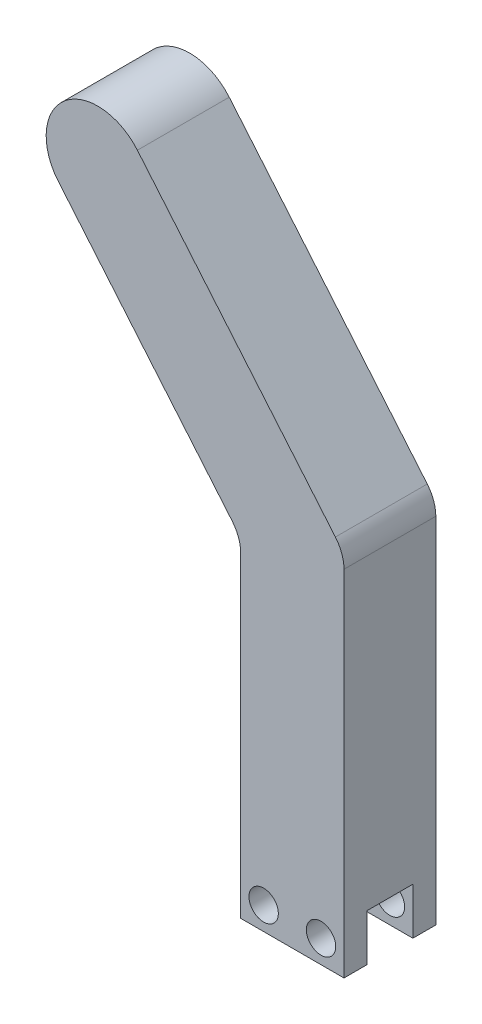
ISO-10303-21;
HEADER;
FILE_DESCRIPTION(('STEP AP214'),'2;1');
FILE_NAME('part.step','',(''),(''),'','','');
FILE_SCHEMA(('AUTOMOTIVE_DESIGN { 1 0 10303 214 1 1 1 1 }'));
ENDSEC;
DATA;
#1=APPLICATION_CONTEXT('core data for automotive mechanical design processes');
#2=APPLICATION_PROTOCOL_DEFINITION('international standard','automotive_design',2000,#1);
#3=PRODUCT_CONTEXT('',#1,'mechanical');
#4=PRODUCT('Part','Part','',(#3));
#5=PRODUCT_RELATED_PRODUCT_CATEGORY('part','',(#4));
#6=PRODUCT_DEFINITION_FORMATION('','',#4);
#7=PRODUCT_DEFINITION_CONTEXT('part definition',#1,'design');
#8=PRODUCT_DEFINITION('design','',#6,#7);
#9=PRODUCT_DEFINITION_SHAPE('','',#8);
#10=(LENGTH_UNIT() NAMED_UNIT(*) SI_UNIT(.MILLI.,.METRE.));
#11=(NAMED_UNIT(*) PLANE_ANGLE_UNIT() SI_UNIT($,.RADIAN.));
#12=(NAMED_UNIT(*) SI_UNIT($,.STERADIAN.) SOLID_ANGLE_UNIT());
#13=UNCERTAINTY_MEASURE_WITH_UNIT(LENGTH_MEASURE(1.E-05),#10,'distance_accuracy_value','');
#14=(GEOMETRIC_REPRESENTATION_CONTEXT(3) GLOBAL_UNCERTAINTY_ASSIGNED_CONTEXT((#13)) GLOBAL_UNIT_ASSIGNED_CONTEXT((#10,
#11,#12)) REPRESENTATION_CONTEXT('',''));
#15=CARTESIAN_POINT('',(0.,0.,0.));
#16=DIRECTION('',(0.,0.,1.));
#17=DIRECTION('',(1.,0.,0.));
#18=AXIS2_PLACEMENT_3D('',#15,#16,#17);
#19=CARTESIAN_POINT('',(0.,-6.35,12.7));
#20=DIRECTION('',(0.,-1.,0.));
#21=DIRECTION('',(1.,0.,0.));
#22=AXIS2_PLACEMENT_3D('',#19,#20,#21);
#23=PLANE('',#22);
#24=DIRECTION('',(-1.,0.,0.));
#25=VECTOR('',#24,1.);
#26=CARTESIAN_POINT('',(0.,-6.35,3.175));
#27=LINE('',#26,#25);
#28=CARTESIAN_POINT('',(0.,-6.35,3.175));
#29=VERTEX_POINT('',#28);
#30=CARTESIAN_POINT('',(-14.2875,-6.35,3.175));
#31=VERTEX_POINT('',#30);
#32=EDGE_CURVE('E128',#29,#31,#27,.T.);
#33=ORIENTED_EDGE('',*,*,#32,.T.);
#34=DIRECTION('',(0.,0.,-1.));
#35=VECTOR('',#34,1.);
#36=CARTESIAN_POINT('',(-14.2875,-6.35,12.7));
#37=LINE('',#36,#35);
#38=CARTESIAN_POINT('',(-14.2875,-6.35,0.));
#39=VERTEX_POINT('',#38);
#40=EDGE_CURVE('E162',#31,#39,#37,.T.);
#41=ORIENTED_EDGE('',*,*,#40,.T.);
#42=DIRECTION('',(-1.,0.,0.));
#43=VECTOR('',#42,1.);
#44=CARTESIAN_POINT('',(0.,-6.35,0.));
#45=LINE('',#44,#43);
#46=CARTESIAN_POINT('',(0.,-6.35,0.));
#47=VERTEX_POINT('',#46);
#48=EDGE_CURVE('E154',#47,#39,#45,.T.);
#49=ORIENTED_EDGE('',*,*,#48,.F.);
#50=DIRECTION('',(0.,0.,-1.));
#51=VECTOR('',#50,1.);
#52=CARTESIAN_POINT('',(0.,-6.35,12.7));
#53=LINE('',#52,#51);
#54=EDGE_CURVE('E146',#29,#47,#53,.T.);
#55=ORIENTED_EDGE('',*,*,#54,.F.);
#56=EDGE_LOOP('',(#33,#41,#49,#55));
#57=FACE_BOUND('',#56,.T.);
#58=ADVANCED_FACE('F38',(#57),#23,.T.);
#59=CARTESIAN_POINT('',(-3.175,-3.175,12.7));
#60=DIRECTION('',(0.,0.,-1.));
#61=DIRECTION('',(-1.,0.,0.));
#62=AXIS2_PLACEMENT_3D('',#59,#60,#61);
#63=CYLINDRICAL_SURFACE('',#62,2.032);
#64=CARTESIAN_POINT('',(-3.175,-3.175,3.175));
#65=DIRECTION('',(0.,0.,-1.));
#66=DIRECTION('',(-1.,0.,0.));
#67=AXIS2_PLACEMENT_3D('',#64,#65,#66);
#68=CIRCLE('',#67,2.032);
#69=CARTESIAN_POINT('',(-5.20699999999999,-3.175,3.175));
#70=VERTEX_POINT('',#69);
#71=EDGE_CURVE('E237',#70,#70,#68,.T.);
#72=ORIENTED_EDGE('',*,*,#71,.F.);
#73=EDGE_LOOP('',(#72));
#74=FACE_BOUND('',#73,.T.);
#75=CARTESIAN_POINT('',(-3.175,-3.175,0.));
#76=DIRECTION('',(0.,0.,1.));
#77=DIRECTION('',(1.,0.,0.));
#78=AXIS2_PLACEMENT_3D('',#75,#76,#77);
#79=CIRCLE('',#78,2.032);
#80=CARTESIAN_POINT('',(-1.143,-3.175,0.));
#81=VERTEX_POINT('',#80);
#82=EDGE_CURVE('E236',#81,#81,#79,.T.);
#83=ORIENTED_EDGE('',*,*,#82,.F.);
#84=EDGE_LOOP('',(#83));
#85=FACE_BOUND('',#84,.T.);
#86=ADVANCED_FACE('F325',(#74,#85),#63,.F.);
#87=CARTESIAN_POINT('',(-11.1125,-3.175,12.7));
#88=DIRECTION('',(0.,0.,-1.));
#89=DIRECTION('',(-1.,0.,0.));
#90=AXIS2_PLACEMENT_3D('',#87,#88,#89);
#91=CYLINDRICAL_SURFACE('',#90,2.032);
#92=CARTESIAN_POINT('',(-11.1125,-3.175,3.175));
#93=DIRECTION('',(0.,0.,-1.));
#94=DIRECTION('',(-1.,0.,0.));
#95=AXIS2_PLACEMENT_3D('',#92,#93,#94);
#96=CIRCLE('',#95,2.032);
#97=CARTESIAN_POINT('',(-13.1445,-3.175,3.175));
#98=VERTEX_POINT('',#97);
#99=EDGE_CURVE('E315',#98,#98,#96,.T.);
#100=ORIENTED_EDGE('',*,*,#99,.F.);
#101=EDGE_LOOP('',(#100));
#102=FACE_BOUND('',#101,.T.);
#103=CARTESIAN_POINT('',(-11.1125,-3.175,0.));
#104=DIRECTION('',(0.,0.,1.));
#105=DIRECTION('',(1.,0.,0.));
#106=AXIS2_PLACEMENT_3D('',#103,#104,#105);
#107=CIRCLE('',#106,2.032);
#108=CARTESIAN_POINT('',(-9.0805,-3.175,0.));
#109=VERTEX_POINT('',#108);
#110=EDGE_CURVE('E232',#109,#109,#107,.T.);
#111=ORIENTED_EDGE('',*,*,#110,.F.);
#112=EDGE_LOOP('',(#111));
#113=FACE_BOUND('',#112,.T.);
#114=ADVANCED_FACE('F328',(#102,#113),#91,.F.);
#115=CARTESIAN_POINT('',(21.8873523106963,18.3656692513525,12.7));
#116=DIRECTION('',(-0.766044443118977,-0.64278760968654,0.));
#117=DIRECTION('',(0.64278760968654,-0.766044443118977,0.));
#118=AXIS2_PLACEMENT_3D('',#115,#116,#117);
#119=PLANE('',#118);
#120=DIRECTION('',(-0.64278760968654,0.766044443118977,0.));
#121=VECTOR('',#120,1.);
#122=CARTESIAN_POINT('',(21.8873523106963,18.3656692513525,12.7));
#123=LINE('',#122,#121);
#124=CARTESIAN_POINT('',(-1.18849422895555,45.8663922671353,12.7));
#125=VERTEX_POINT('',#124);
#126=CARTESIAN_POINT('',(-28.5719092505667,78.5006754966385,12.7));
#127=VERTEX_POINT('',#126);
#128=EDGE_CURVE('E258',#125,#127,#123,.T.);
#129=ORIENTED_EDGE('',*,*,#128,.F.);
#130=DIRECTION('',(0.,0.,-1.));
#131=VECTOR('',#130,1.);
#132=CARTESIAN_POINT('',(-1.18849422895554,45.8663922671353,0.));
#133=LINE('',#132,#131);
#134=CARTESIAN_POINT('',(-1.18849422895555,45.8663922671353,0.));
#135=VERTEX_POINT('',#134);
#136=EDGE_CURVE('E181',#125,#135,#133,.T.);
#137=ORIENTED_EDGE('',*,*,#136,.T.);
#138=DIRECTION('',(-0.64278760968654,0.766044443118977,0.));
#139=VECTOR('',#138,1.);
#140=CARTESIAN_POINT('',(21.8873523106963,18.3656692513525,0.));
#141=LINE('',#140,#139);
#142=CARTESIAN_POINT('',(-28.5719092505667,78.5006754966385,0.));
#143=VERTEX_POINT('',#142);
#144=EDGE_CURVE('E241',#135,#143,#141,.T.);
#145=ORIENTED_EDGE('',*,*,#144,.T.);
#146=DIRECTION('',(0.,0.,-1.));
#147=VECTOR('',#146,1.);
#148=CARTESIAN_POINT('',(-28.5719092505667,78.5006754966385,12.7));
#149=LINE('',#148,#147);
#150=EDGE_CURVE('E177',#127,#143,#149,.T.);
#151=ORIENTED_EDGE('',*,*,#150,.F.);
#152=EDGE_LOOP('',(#129,#137,#145,#151));
#153=FACE_BOUND('',#152,.T.);
#154=ADVANCED_FACE('F274',(#153),#119,.F.);
#155=CARTESIAN_POINT('',(-34.0443392410979,73.9087615099403,12.7));
#156=DIRECTION('',(0.,0.,-1.));
#157=DIRECTION('',(-1.,0.,0.));
#158=AXIS2_PLACEMENT_3D('',#155,#156,#157);
#159=CYLINDRICAL_SURFACE('',#158,7.14375000000002);
#160=CARTESIAN_POINT('',(-34.0443392410979,73.9087615099403,0.));
#161=DIRECTION('',(0.,0.,1.));
#162=DIRECTION('',(1.,0.,0.));
#163=AXIS2_PLACEMENT_3D('',#160,#161,#162);
#164=CIRCLE('',#163,7.14375000000002);
#165=CARTESIAN_POINT('',(-39.5167692316291,69.3168475232421,0.));
#166=VERTEX_POINT('',#165);
#167=EDGE_CURVE('E214',#143,#166,#164,.T.);
#168=ORIENTED_EDGE('',*,*,#167,.T.);
#169=DIRECTION('',(0.,0.,-1.));
#170=VECTOR('',#169,1.);
#171=CARTESIAN_POINT('',(-39.5167692316291,69.3168475232421,12.7));
#172=LINE('',#171,#170);
#173=CARTESIAN_POINT('',(-39.5167692316291,69.3168475232421,12.7));
#174=VERTEX_POINT('',#173);
#175=EDGE_CURVE('E173',#174,#166,#172,.T.);
#176=ORIENTED_EDGE('',*,*,#175,.F.);
#177=CARTESIAN_POINT('',(-34.0443392410979,73.9087615099403,12.7));
#178=DIRECTION('',(0.,0.,1.));
#179=DIRECTION('',(1.,0.,0.));
#180=AXIS2_PLACEMENT_3D('',#177,#178,#179);
#181=CIRCLE('',#180,7.14375000000002);
#182=EDGE_CURVE('E228',#127,#174,#181,.T.);
#183=ORIENTED_EDGE('',*,*,#182,.F.);
#184=ORIENTED_EDGE('',*,*,#150,.T.);
#185=EDGE_LOOP('',(#168,#176,#183,#184));
#186=FACE_BOUND('',#185,.T.);
#187=ADVANCED_FACE('F272',(#186),#159,.T.);
#188=CARTESIAN_POINT('',(10.9424923296339,9.18184127795606,12.7));
#189=DIRECTION('',(-0.766044443118977,-0.64278760968654,0.));
#190=DIRECTION('',(0.64278760968654,-0.766044443118977,0.));
#191=AXIS2_PLACEMENT_3D('',#188,#189,#190);
#192=PLANE('',#191);
#193=DIRECTION('',(-0.64278760968654,0.766044443118977,0.));
#194=VECTOR('',#193,1.);
#195=CARTESIAN_POINT('',(10.9424923296339,9.18184127795606,0.));
#196=LINE('',#195,#194);
#197=CARTESIAN_POINT('',(-15.4759942289556,40.6661675450569,0.));
#198=VERTEX_POINT('',#197);
#199=EDGE_CURVE('E205',#198,#166,#196,.T.);
#200=ORIENTED_EDGE('',*,*,#199,.F.);
#201=DIRECTION('',(0.,0.,-1.));
#202=VECTOR('',#201,1.);
#203=CARTESIAN_POINT('',(-15.4759942289556,40.6661675450569,12.7));
#204=LINE('',#203,#202);
#205=CARTESIAN_POINT('',(-15.4759942289556,40.6661675450569,12.7));
#206=VERTEX_POINT('',#205);
#207=EDGE_CURVE('E60',#198,#206,#204,.F.);
#208=ORIENTED_EDGE('',*,*,#207,.T.);
#209=DIRECTION('',(-0.64278760968654,0.766044443118977,0.));
#210=VECTOR('',#209,1.);
#211=CARTESIAN_POINT('',(10.9424923296339,9.18184127795606,12.7));
#212=LINE('',#211,#210);
#213=EDGE_CURVE('E223',#206,#174,#212,.T.);
#214=ORIENTED_EDGE('',*,*,#213,.T.);
#215=ORIENTED_EDGE('',*,*,#175,.T.);
#216=EDGE_LOOP('',(#200,#208,#214,#215));
#217=FACE_BOUND('',#216,.T.);
#218=ADVANCED_FACE('F210',(#217),#192,.T.);
#219=CARTESIAN_POINT('',(-14.2875,0.,12.7));
#220=DIRECTION('',(-1.,0.,0.));
#221=DIRECTION('',(0.,-1.,0.));
#222=AXIS2_PLACEMENT_3D('',#219,#220,#221);
#223=PLANE('',#222);
#224=DIRECTION('',(0.,1.,0.));
#225=VECTOR('',#224,1.);
#226=CARTESIAN_POINT('',(-14.2875,0.,12.7));
#227=LINE('',#226,#225);
#228=CARTESIAN_POINT('',(-14.2875,-6.35,12.7));
#229=VERTEX_POINT('',#228);
#230=CARTESIAN_POINT('',(-14.2875,37.4008064878493,12.7));
#231=VERTEX_POINT('',#230);
#232=EDGE_CURVE('E218',#229,#231,#227,.T.);
#233=ORIENTED_EDGE('',*,*,#232,.T.);
#234=DIRECTION('',(0.,0.,-1.));
#235=VECTOR('',#234,1.);
#236=CARTESIAN_POINT('',(-14.2875,37.4008064878493,0.));
#237=LINE('',#236,#235);
#238=CARTESIAN_POINT('',(-14.2875,37.4008064878493,0.));
#239=VERTEX_POINT('',#238);
#240=EDGE_CURVE('E194',#231,#239,#237,.T.);
#241=ORIENTED_EDGE('',*,*,#240,.T.);
#242=DIRECTION('',(0.,1.,0.));
#243=VECTOR('',#242,1.);
#244=CARTESIAN_POINT('',(-14.2875,0.,0.));
#245=LINE('',#244,#243);
#246=EDGE_CURVE('E207',#39,#239,#245,.T.);
#247=ORIENTED_EDGE('',*,*,#246,.F.);
#248=ORIENTED_EDGE('',*,*,#40,.F.);
#249=DIRECTION('',(0.,-1.,0.));
#250=VECTOR('',#249,1.);
#251=CARTESIAN_POINT('',(-14.2875,-6.35,3.175));
#252=LINE('',#251,#250);
#253=CARTESIAN_POINT('',(-14.2875,0.121919999999995,3.175));
#254=VERTEX_POINT('',#253);
#255=EDGE_CURVE('E134',#254,#31,#252,.T.);
#256=ORIENTED_EDGE('',*,*,#255,.F.);
#257=DIRECTION('',(0.,0.,-1.));
#258=VECTOR('',#257,1.);
#259=CARTESIAN_POINT('',(-14.2875,0.121919999999995,3.175));
#260=LINE('',#259,#258);
#261=CARTESIAN_POINT('',(-14.2875,0.121919999999997,9.525));
#262=VERTEX_POINT('',#261);
#263=EDGE_CURVE('E151',#262,#254,#260,.T.);
#264=ORIENTED_EDGE('',*,*,#263,.F.);
#265=DIRECTION('',(0.,1.,0.));
#266=VECTOR('',#265,1.);
#267=CARTESIAN_POINT('',(-14.2875,0.121919999999997,9.525));
#268=LINE('',#267,#266);
#269=CARTESIAN_POINT('',(-14.2875,-6.35,9.525));
#270=VERTEX_POINT('',#269);
#271=EDGE_CURVE('E293',#270,#262,#268,.T.);
#272=ORIENTED_EDGE('',*,*,#271,.F.);
#273=EDGE_CURVE('E169',#229,#270,#37,.T.);
#274=ORIENTED_EDGE('',*,*,#273,.F.);
#275=EDGE_LOOP('',(#233,#241,#247,#248,#256,#264,#272,#274));
#276=FACE_BOUND('',#275,.T.);
#277=ADVANCED_FACE('F217',(#276),#223,.T.);
#278=DIRECTION('',(-1.,0.,0.));
#279=VECTOR('',#278,1.);
#280=CARTESIAN_POINT('',(0.,-6.35,9.525));
#281=LINE('',#280,#279);
#282=CARTESIAN_POINT('',(0.,-6.35,9.525));
#283=VERTEX_POINT('',#282);
#284=EDGE_CURVE('E139',#283,#270,#281,.T.);
#285=ORIENTED_EDGE('',*,*,#284,.F.);
#286=CARTESIAN_POINT('',(0.,-6.35,12.7));
#287=VERTEX_POINT('',#286);
#288=EDGE_CURVE('E156',#287,#283,#53,.T.);
#289=ORIENTED_EDGE('',*,*,#288,.F.);
#290=DIRECTION('',(-1.,0.,0.));
#291=VECTOR('',#290,1.);
#292=CARTESIAN_POINT('',(0.,-6.35,12.7));
#293=LINE('',#292,#291);
#294=EDGE_CURVE('E163',#287,#229,#293,.T.);
#295=ORIENTED_EDGE('',*,*,#294,.T.);
#296=ORIENTED_EDGE('',*,*,#273,.T.);
#297=EDGE_LOOP('',(#285,#289,#295,#296));
#298=FACE_BOUND('',#297,.T.);
#299=ADVANCED_FACE('F283',(#298),#23,.T.);
#300=CARTESIAN_POINT('',(-3.175,-3.175,9.525));
#301=DIRECTION('',(0.,0.,1.));
#302=DIRECTION('',(0.,-1.,0.));
#303=AXIS2_PLACEMENT_3D('',#300,#301,#302);
#304=CIRCLE('',#303,2.032);
#305=CARTESIAN_POINT('',(-3.175,-5.20699999999999,9.525));
#306=VERTEX_POINT('',#305);
#307=EDGE_CURVE('E312',#306,#306,#304,.T.);
#308=ORIENTED_EDGE('',*,*,#307,.F.);
#309=EDGE_LOOP('',(#308));
#310=FACE_BOUND('',#309,.T.);
#311=CARTESIAN_POINT('',(-3.175,-3.175,12.7));
#312=DIRECTION('',(0.,0.,1.));
#313=DIRECTION('',(1.,0.,0.));
#314=AXIS2_PLACEMENT_3D('',#311,#312,#313);
#315=CIRCLE('',#314,2.032);
#316=CARTESIAN_POINT('',(-1.143,-3.175,12.7));
#317=VERTEX_POINT('',#316);
#318=EDGE_CURVE('E252',#317,#317,#315,.T.);
#319=ORIENTED_EDGE('',*,*,#318,.T.);
#320=EDGE_LOOP('',(#319));
#321=FACE_BOUND('',#320,.T.);
#322=ADVANCED_FACE('F330',(#310,#321),#63,.F.);
#323=CARTESIAN_POINT('',(-11.1125,-3.175,9.525));
#324=DIRECTION('',(0.,0.,1.));
#325=DIRECTION('',(0.,-1.,0.));
#326=AXIS2_PLACEMENT_3D('',#323,#324,#325);
#327=CIRCLE('',#326,2.032);
#328=CARTESIAN_POINT('',(-11.1125,-5.207,9.525));
#329=VERTEX_POINT('',#328);
#330=EDGE_CURVE('E303',#329,#329,#327,.T.);
#331=ORIENTED_EDGE('',*,*,#330,.F.);
#332=EDGE_LOOP('',(#331));
#333=FACE_BOUND('',#332,.T.);
#334=CARTESIAN_POINT('',(-11.1125,-3.175,12.7));
#335=DIRECTION('',(0.,0.,1.));
#336=DIRECTION('',(1.,0.,0.));
#337=AXIS2_PLACEMENT_3D('',#334,#335,#336);
#338=CIRCLE('',#337,2.032);
#339=CARTESIAN_POINT('',(-9.0805,-3.175,12.7));
#340=VERTEX_POINT('',#339);
#341=EDGE_CURVE('E249',#340,#340,#338,.T.);
#342=ORIENTED_EDGE('',*,*,#341,.T.);
#343=EDGE_LOOP('',(#342));
#344=FACE_BOUND('',#343,.T.);
#345=ADVANCED_FACE('F356',(#333,#344),#91,.F.);
#346=CARTESIAN_POINT('',(0.,0.,12.7));
#347=DIRECTION('',(1.,0.,0.));
#348=DIRECTION('',(0.,1.,0.));
#349=AXIS2_PLACEMENT_3D('',#346,#347,#348);
#350=PLANE('',#349);
#351=DIRECTION('',(0.,-1.,0.));
#352=VECTOR('',#351,1.);
#353=CARTESIAN_POINT('',(0.,0.,0.));
#354=LINE('',#353,#352);
#355=CARTESIAN_POINT('',(0.,42.6010312099276,0.));
#356=VERTEX_POINT('',#355);
#357=EDGE_CURVE('E167',#356,#47,#354,.T.);
#358=ORIENTED_EDGE('',*,*,#357,.F.);
#359=DIRECTION('',(0.,0.,-1.));
#360=VECTOR('',#359,1.);
#361=CARTESIAN_POINT('',(0.,42.6010312099276,12.7));
#362=LINE('',#361,#360);
#363=CARTESIAN_POINT('',(0.,42.6010312099276,12.7));
#364=VERTEX_POINT('',#363);
#365=EDGE_CURVE('E188',#356,#364,#362,.F.);
#366=ORIENTED_EDGE('',*,*,#365,.T.);
#367=DIRECTION('',(0.,-1.,0.));
#368=VECTOR('',#367,1.);
#369=CARTESIAN_POINT('',(0.,0.,12.7));
#370=LINE('',#369,#368);
#371=EDGE_CURVE('E157',#364,#287,#370,.T.);
#372=ORIENTED_EDGE('',*,*,#371,.T.);
#373=ORIENTED_EDGE('',*,*,#288,.T.);
#374=DIRECTION('',(0.,1.,0.));
#375=VECTOR('',#374,1.);
#376=CARTESIAN_POINT('',(0.,0.121919999999996,9.525));
#377=LINE('',#376,#375);
#378=CARTESIAN_POINT('',(0.,0.121919999999997,9.525));
#379=VERTEX_POINT('',#378);
#380=EDGE_CURVE('E150',#283,#379,#377,.T.);
#381=ORIENTED_EDGE('',*,*,#380,.T.);
#382=DIRECTION('',(0.,0.,-1.));
#383=VECTOR('',#382,1.);
#384=CARTESIAN_POINT('',(0.,0.121919999999994,3.175));
#385=LINE('',#384,#383);
#386=CARTESIAN_POINT('',(0.,0.121919999999994,3.175));
#387=VERTEX_POINT('',#386);
#388=EDGE_CURVE('E140',#379,#387,#385,.T.);
#389=ORIENTED_EDGE('',*,*,#388,.T.);
#390=DIRECTION('',(0.,-1.,0.));
#391=VECTOR('',#390,1.);
#392=CARTESIAN_POINT('',(0.,-6.35,3.175));
#393=LINE('',#392,#391);
#394=EDGE_CURVE('E131',#387,#29,#393,.T.);
#395=ORIENTED_EDGE('',*,*,#394,.T.);
#396=ORIENTED_EDGE('',*,*,#54,.T.);
#397=EDGE_LOOP('',(#358,#366,#372,#373,#381,#389,#395,#396));
#398=FACE_BOUND('',#397,.T.);
#399=ADVANCED_FACE('F145',(#398),#350,.T.);
#400=CARTESIAN_POINT('',(0.,0.,12.7));
#401=DIRECTION('',(0.,0.,1.));
#402=DIRECTION('',(1.,0.,0.));
#403=AXIS2_PLACEMENT_3D('',#400,#401,#402);
#404=PLANE('',#403);
#405=ORIENTED_EDGE('',*,*,#341,.F.);
#406=EDGE_LOOP('',(#405));
#407=FACE_BOUND('',#406,.T.);
#408=ORIENTED_EDGE('',*,*,#318,.F.);
#409=EDGE_LOOP('',(#408));
#410=FACE_BOUND('',#409,.T.);
#411=ORIENTED_EDGE('',*,*,#371,.F.);
#412=CARTESIAN_POINT('',(-5.07999999999995,42.6010312099276,12.7));
#413=DIRECTION('',(0.,0.,1.));
#414=DIRECTION('',(1.,0.,0.));
#415=AXIS2_PLACEMENT_3D('',#412,#413,#414);
#416=CIRCLE('',#415,5.08);
#417=EDGE_CURVE('E191',#364,#125,#416,.T.);
#418=ORIENTED_EDGE('',*,*,#417,.T.);
#419=ORIENTED_EDGE('',*,*,#128,.T.);
#420=ORIENTED_EDGE('',*,*,#182,.T.);
#421=ORIENTED_EDGE('',*,*,#213,.F.);
#422=CARTESIAN_POINT('',(-19.3675,37.4008064878493,12.7));
#423=DIRECTION('',(0.,0.,1.));
#424=DIRECTION('',(1.,0.,0.));
#425=AXIS2_PLACEMENT_3D('',#422,#423,#424);
#426=CIRCLE('',#425,5.08);
#427=EDGE_CURVE('E11',#206,#231,#426,.F.);
#428=ORIENTED_EDGE('',*,*,#427,.T.);
#429=ORIENTED_EDGE('',*,*,#232,.F.);
#430=ORIENTED_EDGE('',*,*,#294,.F.);
#431=EDGE_LOOP('',(#411,#418,#419,#420,#421,#428,#429,#430));
#432=FACE_BOUND('',#431,.T.);
#433=ADVANCED_FACE('F268',(#407,#410,#432),#404,.T.);
#434=CARTESIAN_POINT('',(0.,0.,0.));
#435=DIRECTION('',(0.,0.,1.));
#436=DIRECTION('',(1.,0.,0.));
#437=AXIS2_PLACEMENT_3D('',#434,#435,#436);
#438=PLANE('',#437);
#439=ORIENTED_EDGE('',*,*,#110,.T.);
#440=EDGE_LOOP('',(#439));
#441=FACE_BOUND('',#440,.T.);
#442=ORIENTED_EDGE('',*,*,#82,.T.);
#443=EDGE_LOOP('',(#442));
#444=FACE_BOUND('',#443,.T.);
#445=ORIENTED_EDGE('',*,*,#144,.F.);
#446=CARTESIAN_POINT('',(-5.07999999999995,42.6010312099276,0.));
#447=DIRECTION('',(0.,0.,1.));
#448=DIRECTION('',(1.,0.,0.));
#449=AXIS2_PLACEMENT_3D('',#446,#447,#448);
#450=CIRCLE('',#449,5.08);
#451=EDGE_CURVE('E185',#135,#356,#450,.F.);
#452=ORIENTED_EDGE('',*,*,#451,.T.);
#453=ORIENTED_EDGE('',*,*,#357,.T.);
#454=ORIENTED_EDGE('',*,*,#48,.T.);
#455=ORIENTED_EDGE('',*,*,#246,.T.);
#456=CARTESIAN_POINT('',(-19.3675,37.4008064878493,0.));
#457=DIRECTION('',(0.,0.,1.));
#458=DIRECTION('',(1.,0.,0.));
#459=AXIS2_PLACEMENT_3D('',#456,#457,#458);
#460=CIRCLE('',#459,5.08);
#461=EDGE_CURVE('E47',#239,#198,#460,.T.);
#462=ORIENTED_EDGE('',*,*,#461,.T.);
#463=ORIENTED_EDGE('',*,*,#199,.T.);
#464=ORIENTED_EDGE('',*,*,#167,.F.);
#465=EDGE_LOOP('',(#445,#452,#453,#454,#455,#462,#463,#464));
#466=FACE_BOUND('',#465,.T.);
#467=ADVANCED_FACE('F203',(#441,#444,#466),#438,.F.);
#468=CARTESIAN_POINT('',(0.,-6.35,3.175));
#469=DIRECTION('',(0.,0.,-1.));
#470=DIRECTION('',(-1.,0.,0.));
#471=AXIS2_PLACEMENT_3D('',#468,#469,#470);
#472=PLANE('',#471);
#473=ORIENTED_EDGE('',*,*,#71,.T.);
#474=EDGE_LOOP('',(#473));
#475=FACE_BOUND('',#474,.T.);
#476=ORIENTED_EDGE('',*,*,#99,.T.);
#477=EDGE_LOOP('',(#476));
#478=FACE_BOUND('',#477,.T.);
#479=ORIENTED_EDGE('',*,*,#255,.T.);
#480=ORIENTED_EDGE('',*,*,#32,.F.);
#481=ORIENTED_EDGE('',*,*,#394,.F.);
#482=DIRECTION('',(-1.,0.,0.));
#483=VECTOR('',#482,1.);
#484=CARTESIAN_POINT('',(0.,0.121919999999994,3.175));
#485=LINE('',#484,#483);
#486=EDGE_CURVE('E300',#387,#254,#485,.T.);
#487=ORIENTED_EDGE('',*,*,#486,.T.);
#488=EDGE_LOOP('',(#479,#480,#481,#487));
#489=FACE_BOUND('',#488,.T.);
#490=ADVANCED_FACE('F130',(#475,#478,#489),#472,.F.);
#491=CARTESIAN_POINT('',(0.,0.121919999999994,3.175));
#492=DIRECTION('',(0.,1.,0.));
#493=DIRECTION('',(0.,0.,1.));
#494=AXIS2_PLACEMENT_3D('',#491,#492,#493);
#495=PLANE('',#494);
#496=ORIENTED_EDGE('',*,*,#263,.T.);
#497=ORIENTED_EDGE('',*,*,#486,.F.);
#498=ORIENTED_EDGE('',*,*,#388,.F.);
#499=DIRECTION('',(-1.,0.,0.));
#500=VECTOR('',#499,1.);
#501=CARTESIAN_POINT('',(0.,0.121919999999996,9.525));
#502=LINE('',#501,#500);
#503=EDGE_CURVE('E304',#379,#262,#502,.T.);
#504=ORIENTED_EDGE('',*,*,#503,.T.);
#505=EDGE_LOOP('',(#496,#497,#498,#504));
#506=FACE_BOUND('',#505,.T.);
#507=ADVANCED_FACE('F341',(#506),#495,.F.);
#508=CARTESIAN_POINT('',(0.,0.121919999999996,9.525));
#509=DIRECTION('',(0.,0.,1.));
#510=DIRECTION('',(0.,-1.,0.));
#511=AXIS2_PLACEMENT_3D('',#508,#509,#510);
#512=PLANE('',#511);
#513=ORIENTED_EDGE('',*,*,#307,.T.);
#514=EDGE_LOOP('',(#513));
#515=FACE_BOUND('',#514,.T.);
#516=ORIENTED_EDGE('',*,*,#330,.T.);
#517=EDGE_LOOP('',(#516));
#518=FACE_BOUND('',#517,.T.);
#519=ORIENTED_EDGE('',*,*,#271,.T.);
#520=ORIENTED_EDGE('',*,*,#503,.F.);
#521=ORIENTED_EDGE('',*,*,#380,.F.);
#522=ORIENTED_EDGE('',*,*,#284,.T.);
#523=EDGE_LOOP('',(#519,#520,#521,#522));
#524=FACE_BOUND('',#523,.T.);
#525=ADVANCED_FACE('F371',(#515,#518,#524),#512,.F.);
#526=CARTESIAN_POINT('',(-5.07999999999995,42.6010312099276,12.7));
#527=DIRECTION('',(0.,0.,1.));
#528=DIRECTION('',(1.,0.,0.));
#529=AXIS2_PLACEMENT_3D('',#526,#527,#528);
#530=CYLINDRICAL_SURFACE('',#529,5.08);
#531=ORIENTED_EDGE('',*,*,#417,.F.);
#532=ORIENTED_EDGE('',*,*,#365,.F.);
#533=ORIENTED_EDGE('',*,*,#451,.F.);
#534=ORIENTED_EDGE('',*,*,#136,.F.);
#535=EDGE_LOOP('',(#531,#532,#533,#534));
#536=FACE_BOUND('',#535,.T.);
#537=ADVANCED_FACE('F278',(#536),#530,.T.);
#538=CARTESIAN_POINT('',(-19.3675,37.4008064878493,12.7));
#539=DIRECTION('',(0.,0.,1.));
#540=DIRECTION('',(1.,0.,0.));
#541=AXIS2_PLACEMENT_3D('',#538,#539,#540);
#542=CYLINDRICAL_SURFACE('',#541,5.08);
#543=ORIENTED_EDGE('',*,*,#427,.F.);
#544=ORIENTED_EDGE('',*,*,#207,.F.);
#545=ORIENTED_EDGE('',*,*,#461,.F.);
#546=ORIENTED_EDGE('',*,*,#240,.F.);
#547=EDGE_LOOP('',(#543,#544,#545,#546));
#548=FACE_BOUND('',#547,.T.);
#549=ADVANCED_FACE('F40',(#548),#542,.F.);
#550=CLOSED_SHELL('',(#58,#86,#114,#154,#187,#218,#277,#299,#322,#345,#399,#433,#467,#490,#507,
#525,#537,#549));
#551=MANIFOLD_SOLID_BREP('B2',#550);
#552=ADVANCED_BREP_SHAPE_REPRESENTATION('',(#18,#551),#14);
#553=SHAPE_DEFINITION_REPRESENTATION(#9,#552);
ENDSEC;
END-ISO-10303-21;
